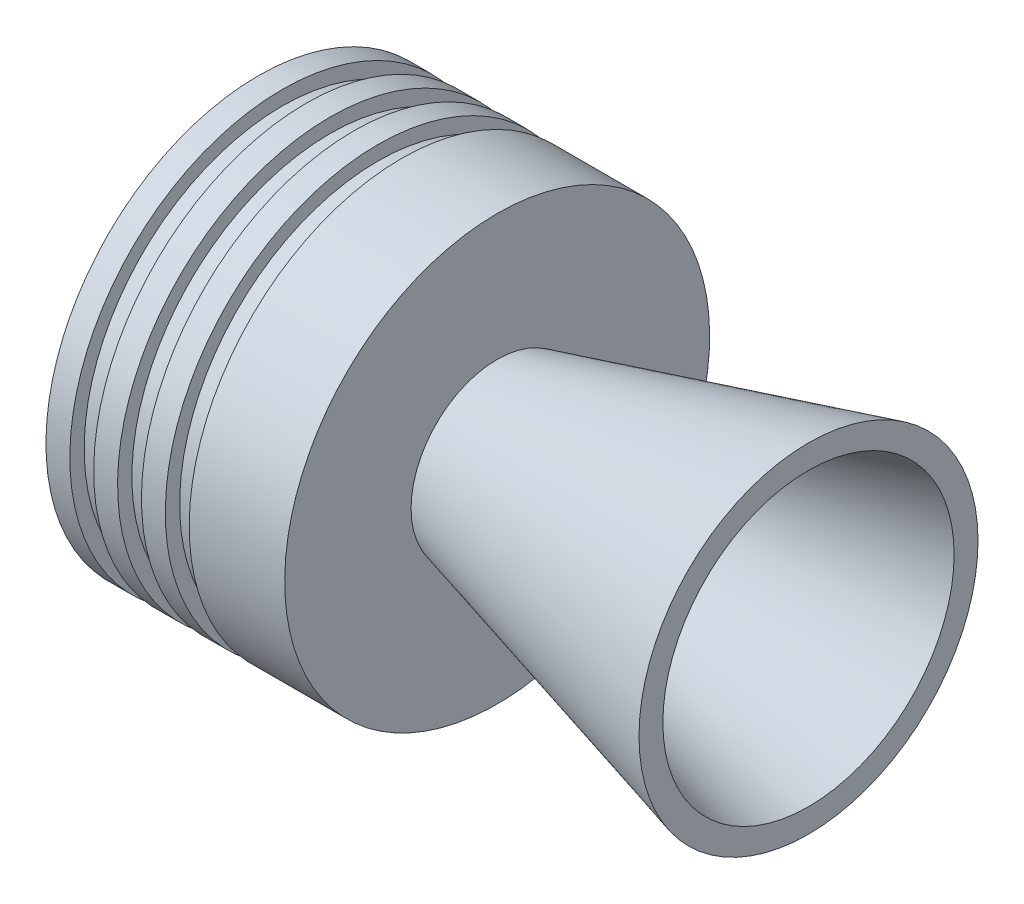
ISO-10303-21;
HEADER;
FILE_DESCRIPTION(('STEP AP214'),'2;1');
FILE_NAME('part.step','',(''),(''),'','','');
FILE_SCHEMA(('AUTOMOTIVE_DESIGN { 1 0 10303 214 1 1 1 1 }'));
ENDSEC;
DATA;
#1=APPLICATION_CONTEXT('core data for automotive mechanical design processes');
#2=APPLICATION_PROTOCOL_DEFINITION('international standard','automotive_design',2000,#1);
#3=PRODUCT_CONTEXT('',#1,'mechanical');
#4=PRODUCT('Part','Part','',(#3));
#5=PRODUCT_RELATED_PRODUCT_CATEGORY('part','',(#4));
#6=PRODUCT_DEFINITION_FORMATION('','',#4);
#7=PRODUCT_DEFINITION_CONTEXT('part definition',#1,'design');
#8=PRODUCT_DEFINITION('design','',#6,#7);
#9=PRODUCT_DEFINITION_SHAPE('','',#8);
#10=(LENGTH_UNIT() NAMED_UNIT(*) SI_UNIT(.MILLI.,.METRE.));
#11=(NAMED_UNIT(*) PLANE_ANGLE_UNIT() SI_UNIT($,.RADIAN.));
#12=(NAMED_UNIT(*) SI_UNIT($,.STERADIAN.) SOLID_ANGLE_UNIT());
#13=UNCERTAINTY_MEASURE_WITH_UNIT(LENGTH_MEASURE(1.E-05),#10,'distance_accuracy_value','');
#14=(GEOMETRIC_REPRESENTATION_CONTEXT(3) GLOBAL_UNCERTAINTY_ASSIGNED_CONTEXT((#13)) GLOBAL_UNIT_ASSIGNED_CONTEXT((#10,
#11,#12)) REPRESENTATION_CONTEXT('',''));
#15=CARTESIAN_POINT('',(0.,0.,0.));
#16=DIRECTION('',(0.,0.,1.));
#17=DIRECTION('',(1.,0.,0.));
#18=AXIS2_PLACEMENT_3D('',#15,#16,#17);
#19=CARTESIAN_POINT('',(0.,0.,0.));
#20=DIRECTION('',(1.,0.,0.));
#21=DIRECTION('',(0.,1.,0.));
#22=AXIS2_PLACEMENT_3D('',#19,#20,#21);
#23=CYLINDRICAL_SURFACE('',#22,11.5);
#24=CARTESIAN_POINT('',(-82.1051177665174,0.,0.));
#25=DIRECTION('',(1.,0.,0.));
#26=DIRECTION('',(0.,1.,0.));
#27=AXIS2_PLACEMENT_3D('',#24,#25,#26);
#28=CIRCLE('',#27,11.5);
#29=CARTESIAN_POINT('',(-82.1051177665174,11.5,0.));
#30=VERTEX_POINT('',#29);
#31=EDGE_CURVE('E93',#30,#30,#28,.T.);
#32=ORIENTED_EDGE('',*,*,#31,.T.);
#33=EDGE_LOOP('',(#32));
#34=FACE_BOUND('',#33,.T.);
#35=CARTESIAN_POINT('',(-83.1051177665174,0.,0.));
#36=DIRECTION('',(1.,0.,0.));
#37=DIRECTION('',(0.,1.,0.));
#38=AXIS2_PLACEMENT_3D('',#35,#36,#37);
#39=CIRCLE('',#38,11.5);
#40=CARTESIAN_POINT('',(-83.1051177665174,11.5,0.));
#41=VERTEX_POINT('',#40);
#42=EDGE_CURVE('E10',#41,#41,#39,.T.);
#43=ORIENTED_EDGE('',*,*,#42,.F.);
#44=EDGE_LOOP('',(#43));
#45=FACE_BOUND('',#44,.T.);
#46=ADVANCED_FACE('F35',(#34,#45),#23,.F.);
#47=CARTESIAN_POINT('',(-126.4,0.,0.));
#48=DIRECTION('',(-1.,0.,0.));
#49=DIRECTION('',(0.,-1.,0.));
#50=AXIS2_PLACEMENT_3D('',#47,#48,#49);
#51=CONICAL_SURFACE('',#50,36.4963119120344,0.5235987755983);
#52=ORIENTED_EDGE('',*,*,#42,.T.);
#53=EDGE_LOOP('',(#52));
#54=FACE_BOUND('',#53,.T.);
#55=CARTESIAN_POINT('',(-126.4,0.,0.));
#56=DIRECTION('',(1.,0.,0.));
#57=DIRECTION('',(0.,1.,0.));
#58=AXIS2_PLACEMENT_3D('',#55,#56,#57);
#59=CIRCLE('',#58,36.4963119120344);
#60=CARTESIAN_POINT('',(-126.4,36.4963119120344,0.));
#61=VERTEX_POINT('',#60);
#62=EDGE_CURVE('E42',#61,#61,#59,.T.);
#63=ORIENTED_EDGE('',*,*,#62,.F.);
#64=EDGE_LOOP('',(#63));
#65=FACE_BOUND('',#64,.T.);
#66=ADVANCED_FACE('F114',(#54,#65),#51,.F.);
#67=CARTESIAN_POINT('',(-126.4,36.4963119120344,0.));
#68=DIRECTION('',(-1.,0.,0.));
#69=DIRECTION('',(0.,-1.,0.));
#70=AXIS2_PLACEMENT_3D('',#67,#68,#69);
#71=PLANE('',#70);
#72=ORIENTED_EDGE('',*,*,#62,.T.);
#73=EDGE_LOOP('',(#72));
#74=FACE_BOUND('',#73,.T.);
#75=CARTESIAN_POINT('',(-126.4,0.,0.));
#76=DIRECTION('',(1.,0.,0.));
#77=DIRECTION('',(0.,1.,0.));
#78=AXIS2_PLACEMENT_3D('',#75,#76,#77);
#79=CIRCLE('',#78,44.4963119120344);
#80=CARTESIAN_POINT('',(-126.4,44.4963119120344,0.));
#81=VERTEX_POINT('',#80);
#82=EDGE_CURVE('E46',#81,#81,#79,.T.);
#83=ORIENTED_EDGE('',*,*,#82,.F.);
#84=EDGE_LOOP('',(#83));
#85=FACE_BOUND('',#84,.T.);
#86=ADVANCED_FACE('F118',(#74,#85),#71,.T.);
#87=CARTESIAN_POINT('',(0.,0.,0.));
#88=DIRECTION('',(1.,0.,0.));
#89=DIRECTION('',(0.,1.,0.));
#90=AXIS2_PLACEMENT_3D('',#87,#88,#89);
#91=CYLINDRICAL_SURFACE('',#90,44.4963119120344);
#92=ORIENTED_EDGE('',*,*,#82,.T.);
#93=EDGE_LOOP('',(#92));
#94=FACE_BOUND('',#93,.T.);
#95=CARTESIAN_POINT('',(-121.4,0.,0.));
#96=DIRECTION('',(1.,0.,0.));
#97=DIRECTION('',(0.,1.,0.));
#98=AXIS2_PLACEMENT_3D('',#95,#96,#97);
#99=CIRCLE('',#98,44.4963119120344);
#100=CARTESIAN_POINT('',(-121.4,44.4963119120344,0.));
#101=VERTEX_POINT('',#100);
#102=EDGE_CURVE('E51',#101,#101,#99,.T.);
#103=ORIENTED_EDGE('',*,*,#102,.F.);
#104=EDGE_LOOP('',(#103));
#105=FACE_BOUND('',#104,.T.);
#106=ADVANCED_FACE('F122',(#94,#105),#91,.T.);
#107=CARTESIAN_POINT('',(-121.4,44.4963119120344,0.));
#108=DIRECTION('',(1.,0.,0.));
#109=DIRECTION('',(0.,1.,0.));
#110=AXIS2_PLACEMENT_3D('',#107,#108,#109);
#111=PLANE('',#110);
#112=ORIENTED_EDGE('',*,*,#102,.T.);
#113=EDGE_LOOP('',(#112));
#114=FACE_BOUND('',#113,.T.);
#115=CARTESIAN_POINT('',(-121.4,0.,0.));
#116=DIRECTION('',(1.,0.,0.));
#117=DIRECTION('',(0.,1.,0.));
#118=AXIS2_PLACEMENT_3D('',#115,#116,#117);
#119=CIRCLE('',#118,41.4963119120344);
#120=CARTESIAN_POINT('',(-121.4,41.4963119120344,0.));
#121=VERTEX_POINT('',#120);
#122=EDGE_CURVE('E54',#121,#121,#119,.T.);
#123=ORIENTED_EDGE('',*,*,#122,.F.);
#124=EDGE_LOOP('',(#123));
#125=FACE_BOUND('',#124,.T.);
#126=ADVANCED_FACE('F129',(#114,#125),#111,.T.);
#127=CARTESIAN_POINT('',(0.,0.,0.));
#128=DIRECTION('',(1.,0.,0.));
#129=DIRECTION('',(0.,1.,0.));
#130=AXIS2_PLACEMENT_3D('',#127,#128,#129);
#131=CYLINDRICAL_SURFACE('',#130,41.4963119120344);
#132=ORIENTED_EDGE('',*,*,#122,.T.);
#133=EDGE_LOOP('',(#132));
#134=FACE_BOUND('',#133,.T.);
#135=CARTESIAN_POINT('',(-116.4,0.,0.));
#136=DIRECTION('',(1.,0.,0.));
#137=DIRECTION('',(0.,1.,0.));
#138=AXIS2_PLACEMENT_3D('',#135,#136,#137);
#139=CIRCLE('',#138,41.4963119120344);
#140=CARTESIAN_POINT('',(-116.4,41.4963119120344,0.));
#141=VERTEX_POINT('',#140);
#142=EDGE_CURVE('E57',#141,#141,#139,.T.);
#143=ORIENTED_EDGE('',*,*,#142,.F.);
#144=EDGE_LOOP('',(#143));
#145=FACE_BOUND('',#144,.T.);
#146=ADVANCED_FACE('F133',(#134,#145),#131,.T.);
#147=CARTESIAN_POINT('',(-116.4,41.4963119120344,0.));
#148=DIRECTION('',(-1.,0.,0.));
#149=DIRECTION('',(0.,-1.,0.));
#150=AXIS2_PLACEMENT_3D('',#147,#148,#149);
#151=PLANE('',#150);
#152=ORIENTED_EDGE('',*,*,#142,.T.);
#153=EDGE_LOOP('',(#152));
#154=FACE_BOUND('',#153,.T.);
#155=CARTESIAN_POINT('',(-116.4,0.,0.));
#156=DIRECTION('',(1.,0.,0.));
#157=DIRECTION('',(0.,1.,0.));
#158=AXIS2_PLACEMENT_3D('',#155,#156,#157);
#159=CIRCLE('',#158,44.4963119120344);
#160=CARTESIAN_POINT('',(-116.4,44.4963119120344,0.));
#161=VERTEX_POINT('',#160);
#162=EDGE_CURVE('E60',#161,#161,#159,.T.);
#163=ORIENTED_EDGE('',*,*,#162,.F.);
#164=EDGE_LOOP('',(#163));
#165=FACE_BOUND('',#164,.T.);
#166=ADVANCED_FACE('F137',(#154,#165),#151,.T.);
#167=CARTESIAN_POINT('',(0.,0.,0.));
#168=DIRECTION('',(1.,0.,0.));
#169=DIRECTION('',(0.,1.,0.));
#170=AXIS2_PLACEMENT_3D('',#167,#168,#169);
#171=CYLINDRICAL_SURFACE('',#170,44.4963119120344);
#172=ORIENTED_EDGE('',*,*,#162,.T.);
#173=EDGE_LOOP('',(#172));
#174=FACE_BOUND('',#173,.T.);
#175=CARTESIAN_POINT('',(-111.4,0.,0.));
#176=DIRECTION('',(1.,0.,0.));
#177=DIRECTION('',(0.,1.,0.));
#178=AXIS2_PLACEMENT_3D('',#175,#176,#177);
#179=CIRCLE('',#178,44.4963119120344);
#180=CARTESIAN_POINT('',(-111.4,44.4963119120344,0.));
#181=VERTEX_POINT('',#180);
#182=EDGE_CURVE('E63',#181,#181,#179,.T.);
#183=ORIENTED_EDGE('',*,*,#182,.F.);
#184=EDGE_LOOP('',(#183));
#185=FACE_BOUND('',#184,.T.);
#186=ADVANCED_FACE('F141',(#174,#185),#171,.T.);
#187=CARTESIAN_POINT('',(-111.4,44.4963119120344,0.));
#188=DIRECTION('',(1.,0.,0.));
#189=DIRECTION('',(0.,1.,0.));
#190=AXIS2_PLACEMENT_3D('',#187,#188,#189);
#191=PLANE('',#190);
#192=ORIENTED_EDGE('',*,*,#182,.T.);
#193=EDGE_LOOP('',(#192));
#194=FACE_BOUND('',#193,.T.);
#195=CARTESIAN_POINT('',(-111.4,0.,0.));
#196=DIRECTION('',(1.,0.,0.));
#197=DIRECTION('',(0.,1.,0.));
#198=AXIS2_PLACEMENT_3D('',#195,#196,#197);
#199=CIRCLE('',#198,41.4963119120344);
#200=CARTESIAN_POINT('',(-111.4,41.4963119120344,0.));
#201=VERTEX_POINT('',#200);
#202=EDGE_CURVE('E66',#201,#201,#199,.T.);
#203=ORIENTED_EDGE('',*,*,#202,.F.);
#204=EDGE_LOOP('',(#203));
#205=FACE_BOUND('',#204,.T.);
#206=ADVANCED_FACE('F145',(#194,#205),#191,.T.);
#207=CARTESIAN_POINT('',(0.,0.,0.));
#208=DIRECTION('',(1.,0.,0.));
#209=DIRECTION('',(0.,1.,0.));
#210=AXIS2_PLACEMENT_3D('',#207,#208,#209);
#211=CYLINDRICAL_SURFACE('',#210,41.4963119120344);
#212=ORIENTED_EDGE('',*,*,#202,.T.);
#213=EDGE_LOOP('',(#212));
#214=FACE_BOUND('',#213,.T.);
#215=CARTESIAN_POINT('',(-106.4,0.,0.));
#216=DIRECTION('',(1.,0.,0.));
#217=DIRECTION('',(0.,1.,0.));
#218=AXIS2_PLACEMENT_3D('',#215,#216,#217);
#219=CIRCLE('',#218,41.4963119120344);
#220=CARTESIAN_POINT('',(-106.4,41.4963119120344,0.));
#221=VERTEX_POINT('',#220);
#222=EDGE_CURVE('E69',#221,#221,#219,.T.);
#223=ORIENTED_EDGE('',*,*,#222,.F.);
#224=EDGE_LOOP('',(#223));
#225=FACE_BOUND('',#224,.T.);
#226=ADVANCED_FACE('F149',(#214,#225),#211,.T.);
#227=CARTESIAN_POINT('',(-106.4,41.4963119120344,0.));
#228=DIRECTION('',(-1.,0.,0.));
#229=DIRECTION('',(0.,-1.,0.));
#230=AXIS2_PLACEMENT_3D('',#227,#228,#229);
#231=PLANE('',#230);
#232=ORIENTED_EDGE('',*,*,#222,.T.);
#233=EDGE_LOOP('',(#232));
#234=FACE_BOUND('',#233,.T.);
#235=CARTESIAN_POINT('',(-106.4,0.,0.));
#236=DIRECTION('',(1.,0.,0.));
#237=DIRECTION('',(0.,1.,0.));
#238=AXIS2_PLACEMENT_3D('',#235,#236,#237);
#239=CIRCLE('',#238,44.4963119120344);
#240=CARTESIAN_POINT('',(-106.4,44.4963119120344,0.));
#241=VERTEX_POINT('',#240);
#242=EDGE_CURVE('E72',#241,#241,#239,.T.);
#243=ORIENTED_EDGE('',*,*,#242,.F.);
#244=EDGE_LOOP('',(#243));
#245=FACE_BOUND('',#244,.T.);
#246=ADVANCED_FACE('F153',(#234,#245),#231,.T.);
#247=CARTESIAN_POINT('',(0.,0.,0.));
#248=DIRECTION('',(1.,0.,0.));
#249=DIRECTION('',(0.,1.,0.));
#250=AXIS2_PLACEMENT_3D('',#247,#248,#249);
#251=CYLINDRICAL_SURFACE('',#250,44.4963119120344);
#252=ORIENTED_EDGE('',*,*,#242,.T.);
#253=EDGE_LOOP('',(#252));
#254=FACE_BOUND('',#253,.T.);
#255=CARTESIAN_POINT('',(-101.4,0.,0.));
#256=DIRECTION('',(1.,0.,0.));
#257=DIRECTION('',(0.,1.,0.));
#258=AXIS2_PLACEMENT_3D('',#255,#256,#257);
#259=CIRCLE('',#258,44.4963119120344);
#260=CARTESIAN_POINT('',(-101.4,44.4963119120344,0.));
#261=VERTEX_POINT('',#260);
#262=EDGE_CURVE('E75',#261,#261,#259,.T.);
#263=ORIENTED_EDGE('',*,*,#262,.F.);
#264=EDGE_LOOP('',(#263));
#265=FACE_BOUND('',#264,.T.);
#266=ADVANCED_FACE('F157',(#254,#265),#251,.T.);
#267=CARTESIAN_POINT('',(-101.4,44.4963119120344,0.));
#268=DIRECTION('',(1.,0.,0.));
#269=DIRECTION('',(0.,1.,0.));
#270=AXIS2_PLACEMENT_3D('',#267,#268,#269);
#271=PLANE('',#270);
#272=ORIENTED_EDGE('',*,*,#262,.T.);
#273=EDGE_LOOP('',(#272));
#274=FACE_BOUND('',#273,.T.);
#275=CARTESIAN_POINT('',(-101.4,0.,0.));
#276=DIRECTION('',(1.,0.,0.));
#277=DIRECTION('',(0.,1.,0.));
#278=AXIS2_PLACEMENT_3D('',#275,#276,#277);
#279=CIRCLE('',#278,41.4963119120344);
#280=CARTESIAN_POINT('',(-101.4,41.4963119120344,0.));
#281=VERTEX_POINT('',#280);
#282=EDGE_CURVE('E78',#281,#281,#279,.T.);
#283=ORIENTED_EDGE('',*,*,#282,.F.);
#284=EDGE_LOOP('',(#283));
#285=FACE_BOUND('',#284,.T.);
#286=ADVANCED_FACE('F161',(#274,#285),#271,.T.);
#287=CARTESIAN_POINT('',(0.,0.,0.));
#288=DIRECTION('',(1.,0.,0.));
#289=DIRECTION('',(0.,1.,0.));
#290=AXIS2_PLACEMENT_3D('',#287,#288,#289);
#291=CYLINDRICAL_SURFACE('',#290,41.4963119120344);
#292=ORIENTED_EDGE('',*,*,#282,.T.);
#293=EDGE_LOOP('',(#292));
#294=FACE_BOUND('',#293,.T.);
#295=CARTESIAN_POINT('',(-96.3999999999999,0.,0.));
#296=DIRECTION('',(1.,0.,0.));
#297=DIRECTION('',(0.,1.,0.));
#298=AXIS2_PLACEMENT_3D('',#295,#296,#297);
#299=CIRCLE('',#298,41.4963119120344);
#300=CARTESIAN_POINT('',(-96.3999999999999,41.4963119120344,0.));
#301=VERTEX_POINT('',#300);
#302=EDGE_CURVE('E81',#301,#301,#299,.T.);
#303=ORIENTED_EDGE('',*,*,#302,.F.);
#304=EDGE_LOOP('',(#303));
#305=FACE_BOUND('',#304,.T.);
#306=ADVANCED_FACE('F165',(#294,#305),#291,.T.);
#307=CARTESIAN_POINT('',(-96.3999999999999,41.4963119120344,0.));
#308=DIRECTION('',(-1.,0.,0.));
#309=DIRECTION('',(0.,-1.,0.));
#310=AXIS2_PLACEMENT_3D('',#307,#308,#309);
#311=PLANE('',#310);
#312=ORIENTED_EDGE('',*,*,#302,.T.);
#313=EDGE_LOOP('',(#312));
#314=FACE_BOUND('',#313,.T.);
#315=CARTESIAN_POINT('',(-96.3999999999999,0.,0.));
#316=DIRECTION('',(1.,0.,0.));
#317=DIRECTION('',(0.,1.,0.));
#318=AXIS2_PLACEMENT_3D('',#315,#316,#317);
#319=CIRCLE('',#318,44.4963119120344);
#320=CARTESIAN_POINT('',(-96.3999999999999,44.4963119120344,0.));
#321=VERTEX_POINT('',#320);
#322=EDGE_CURVE('E84',#321,#321,#319,.T.);
#323=ORIENTED_EDGE('',*,*,#322,.F.);
#324=EDGE_LOOP('',(#323));
#325=FACE_BOUND('',#324,.T.);
#326=ADVANCED_FACE('F169',(#314,#325),#311,.T.);
#327=CARTESIAN_POINT('',(0.,0.,0.));
#328=DIRECTION('',(1.,0.,0.));
#329=DIRECTION('',(0.,1.,0.));
#330=AXIS2_PLACEMENT_3D('',#327,#328,#329);
#331=CYLINDRICAL_SURFACE('',#330,44.4963119120344);
#332=ORIENTED_EDGE('',*,*,#322,.T.);
#333=EDGE_LOOP('',(#332));
#334=FACE_BOUND('',#333,.T.);
#335=CARTESIAN_POINT('',(-76.4,0.,0.));
#336=DIRECTION('',(1.,0.,0.));
#337=DIRECTION('',(0.,1.,0.));
#338=AXIS2_PLACEMENT_3D('',#335,#336,#337);
#339=CIRCLE('',#338,44.4963119120344);
#340=CARTESIAN_POINT('',(-76.4,44.4963119120344,0.));
#341=VERTEX_POINT('',#340);
#342=EDGE_CURVE('E87',#341,#341,#339,.T.);
#343=ORIENTED_EDGE('',*,*,#342,.F.);
#344=EDGE_LOOP('',(#343));
#345=FACE_BOUND('',#344,.T.);
#346=ADVANCED_FACE('F173',(#334,#345),#331,.T.);
#347=CARTESIAN_POINT('',(-76.4,44.4963119120344,0.));
#348=DIRECTION('',(1.,0.,0.));
#349=DIRECTION('',(0.,1.,0.));
#350=AXIS2_PLACEMENT_3D('',#347,#348,#349);
#351=PLANE('',#350);
#352=ORIENTED_EDGE('',*,*,#342,.T.);
#353=EDGE_LOOP('',(#352));
#354=FACE_BOUND('',#353,.T.);
#355=CARTESIAN_POINT('',(-76.4,0.,0.));
#356=DIRECTION('',(1.,0.,0.));
#357=DIRECTION('',(0.,1.,0.));
#358=AXIS2_PLACEMENT_3D('',#355,#356,#357);
#359=CIRCLE('',#358,18.0286816982628);
#360=CARTESIAN_POINT('',(-76.4,18.0286816982628,0.));
#361=VERTEX_POINT('',#360);
#362=EDGE_CURVE('E90',#361,#361,#359,.T.);
#363=ORIENTED_EDGE('',*,*,#362,.F.);
#364=EDGE_LOOP('',(#363));
#365=FACE_BOUND('',#364,.T.);
#366=ADVANCED_FACE('F177',(#354,#365),#351,.T.);
#367=CARTESIAN_POINT('',(0.,0.,0.));
#368=DIRECTION('',(1.,0.,0.));
#369=DIRECTION('',(0.,1.,0.));
#370=AXIS2_PLACEMENT_3D('',#367,#368,#369);
#371=CONICAL_SURFACE('',#370,38.5,0.261799387799143);
#372=CARTESIAN_POINT('',(-11.1961524227069,0.,0.));
#373=DIRECTION('',(-1.,0.,0.));
#374=DIRECTION('',(0.,-1.,0.));
#375=AXIS2_PLACEMENT_3D('',#372,#373,#374);
#376=CIRCLE('',#375,35.5);
#377=CARTESIAN_POINT('',(-11.1961524227069,-35.5,0.));
#378=VERTEX_POINT('',#377);
#379=EDGE_CURVE('E96',#378,#378,#376,.F.);
#380=ORIENTED_EDGE('',*,*,#379,.F.);
#381=EDGE_LOOP('',(#380));
#382=FACE_BOUND('',#381,.T.);
#383=ORIENTED_EDGE('',*,*,#362,.T.);
#384=EDGE_LOOP('',(#383));
#385=FACE_BOUND('',#384,.T.);
#386=ADVANCED_FACE('F108',(#382,#385),#371,.T.);
#387=CARTESIAN_POINT('',(-82.1051177665174,0.,0.));
#388=DIRECTION('',(1.,0.,0.));
#389=DIRECTION('',(0.,1.,0.));
#390=AXIS2_PLACEMENT_3D('',#387,#388,#389);
#391=CONICAL_SURFACE('',#390,11.5,0.261799387799143);
#392=CARTESIAN_POINT('',(-11.1961524227069,0.,0.));
#393=DIRECTION('',(-1.,0.,0.));
#394=DIRECTION('',(0.,-1.,0.));
#395=AXIS2_PLACEMENT_3D('',#392,#393,#394);
#396=CIRCLE('',#395,30.5);
#397=CARTESIAN_POINT('',(-11.1961524227069,-30.5,0.));
#398=VERTEX_POINT('',#397);
#399=EDGE_CURVE('E38',#398,#398,#396,.T.);
#400=ORIENTED_EDGE('',*,*,#399,.F.);
#401=EDGE_LOOP('',(#400));
#402=FACE_BOUND('',#401,.T.);
#403=ORIENTED_EDGE('',*,*,#31,.F.);
#404=EDGE_LOOP('',(#403));
#405=FACE_BOUND('',#404,.T.);
#406=ADVANCED_FACE('F105',(#402,#405),#391,.F.);
#407=CARTESIAN_POINT('',(-11.1961524227069,35.5,0.));
#408=DIRECTION('',(-1.,0.,0.));
#409=DIRECTION('',(0.,-1.,0.));
#410=AXIS2_PLACEMENT_3D('',#407,#408,#409);
#411=PLANE('',#410);
#412=ORIENTED_EDGE('',*,*,#379,.T.);
#413=EDGE_LOOP('',(#412));
#414=FACE_BOUND('',#413,.T.);
#415=ORIENTED_EDGE('',*,*,#399,.T.);
#416=EDGE_LOOP('',(#415));
#417=FACE_BOUND('',#416,.T.);
#418=ADVANCED_FACE('F103',(#414,#417),#411,.F.);
#419=CLOSED_SHELL('',(#46,#66,#86,#106,#126,#146,#166,#186,#206,#226,#246,#266,#286,#306,#326,
#346,#366,#386,#406,#418));
#420=MANIFOLD_SOLID_BREP('B2',#419);
#421=ADVANCED_BREP_SHAPE_REPRESENTATION('',(#18,#420),#14);
#422=SHAPE_DEFINITION_REPRESENTATION(#9,#421);
ENDSEC;
END-ISO-10303-21;
